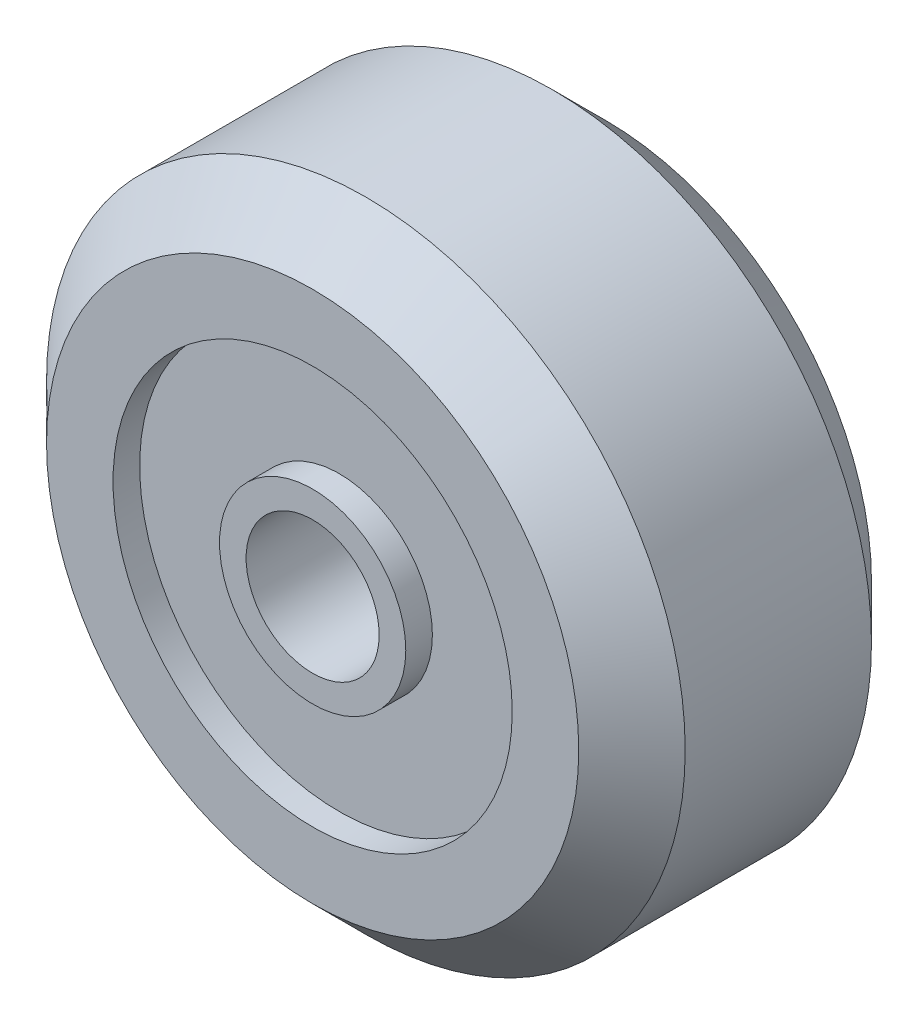
ISO-10303-21;
HEADER;
FILE_DESCRIPTION(('STEP AP214'),'2;1');
FILE_NAME('part.step','',(''),(''),'','','');
FILE_SCHEMA(('AUTOMOTIVE_DESIGN { 1 0 10303 214 1 1 1 1 }'));
ENDSEC;
DATA;
#1=APPLICATION_CONTEXT('core data for automotive mechanical design processes');
#2=APPLICATION_PROTOCOL_DEFINITION('international standard','automotive_design',2000,#1);
#3=PRODUCT_CONTEXT('',#1,'mechanical');
#4=PRODUCT('Part','Part','',(#3));
#5=PRODUCT_RELATED_PRODUCT_CATEGORY('part','',(#4));
#6=PRODUCT_DEFINITION_FORMATION('','',#4);
#7=PRODUCT_DEFINITION_CONTEXT('part definition',#1,'design');
#8=PRODUCT_DEFINITION('design','',#6,#7);
#9=PRODUCT_DEFINITION_SHAPE('','',#8);
#10=(LENGTH_UNIT() NAMED_UNIT(*) SI_UNIT(.MILLI.,.METRE.));
#11=(NAMED_UNIT(*) PLANE_ANGLE_UNIT() SI_UNIT($,.RADIAN.));
#12=(NAMED_UNIT(*) SI_UNIT($,.STERADIAN.) SOLID_ANGLE_UNIT());
#13=UNCERTAINTY_MEASURE_WITH_UNIT(LENGTH_MEASURE(1.E-05),#10,'distance_accuracy_value','');
#14=(GEOMETRIC_REPRESENTATION_CONTEXT(3) GLOBAL_UNCERTAINTY_ASSIGNED_CONTEXT((#13)) GLOBAL_UNIT_ASSIGNED_CONTEXT((#10,
#11,#12)) REPRESENTATION_CONTEXT('',''));
#15=CARTESIAN_POINT('',(0.,0.,0.));
#16=DIRECTION('',(0.,0.,1.));
#17=DIRECTION('',(1.,0.,0.));
#18=AXIS2_PLACEMENT_3D('',#15,#16,#17);
#19=CARTESIAN_POINT('',(0.,0.,0.));
#20=DIRECTION('',(0.,0.,1.));
#21=DIRECTION('',(1.,0.,0.));
#22=AXIS2_PLACEMENT_3D('',#19,#20,#21);
#23=PLANE('',#22);
#24=CARTESIAN_POINT('',(0.,0.,0.));
#25=DIRECTION('',(0.,0.,1.));
#26=DIRECTION('',(1.,0.,0.));
#27=AXIS2_PLACEMENT_3D('',#24,#25,#26);
#28=CIRCLE('',#27,2.5);
#29=CARTESIAN_POINT('',(2.5,0.,0.));
#30=VERTEX_POINT('',#29);
#31=EDGE_CURVE('E60',#30,#30,#28,.T.);
#32=ORIENTED_EDGE('',*,*,#31,.T.);
#33=EDGE_LOOP('',(#32));
#34=FACE_BOUND('',#33,.T.);
#35=CARTESIAN_POINT('',(0.,0.,0.));
#36=DIRECTION('',(0.,0.,-1.));
#37=DIRECTION('',(-1.,0.,0.));
#38=AXIS2_PLACEMENT_3D('',#35,#36,#37);
#39=CIRCLE('',#38,3.5);
#40=CARTESIAN_POINT('',(-3.5,0.,0.));
#41=VERTEX_POINT('',#40);
#42=EDGE_CURVE('E85',#41,#41,#39,.T.);
#43=ORIENTED_EDGE('',*,*,#42,.T.);
#44=EDGE_LOOP('',(#43));
#45=FACE_BOUND('',#44,.T.);
#46=ADVANCED_FACE('F39',(#34,#45),#23,.F.);
#47=CARTESIAN_POINT('',(0.,0.,11.));
#48=DIRECTION('',(0.,0.,1.));
#49=DIRECTION('',(1.,0.,0.));
#50=AXIS2_PLACEMENT_3D('',#47,#48,#49);
#51=PLANE('',#50);
#52=CARTESIAN_POINT('',(0.,0.,11.));
#53=DIRECTION('',(0.,0.,1.));
#54=DIRECTION('',(1.,0.,0.));
#55=AXIS2_PLACEMENT_3D('',#52,#53,#54);
#56=CIRCLE('',#55,2.5);
#57=CARTESIAN_POINT('',(2.5,0.,11.));
#58=VERTEX_POINT('',#57);
#59=EDGE_CURVE('E61',#58,#58,#56,.T.);
#60=ORIENTED_EDGE('',*,*,#59,.F.);
#61=EDGE_LOOP('',(#60));
#62=FACE_BOUND('',#61,.T.);
#63=CARTESIAN_POINT('',(0.,0.,11.));
#64=DIRECTION('',(0.,0.,1.));
#65=DIRECTION('',(1.,0.,0.));
#66=AXIS2_PLACEMENT_3D('',#63,#64,#65);
#67=CIRCLE('',#66,3.5);
#68=CARTESIAN_POINT('',(3.5,0.,11.));
#69=VERTEX_POINT('',#68);
#70=EDGE_CURVE('E73',#69,#69,#67,.T.);
#71=ORIENTED_EDGE('',*,*,#70,.T.);
#72=EDGE_LOOP('',(#71));
#73=FACE_BOUND('',#72,.T.);
#74=ADVANCED_FACE('F120',(#62,#73),#51,.T.);
#75=CARTESIAN_POINT('',(0.,0.,11.));
#76=DIRECTION('',(0.,0.,-1.));
#77=DIRECTION('',(-1.,0.,0.));
#78=AXIS2_PLACEMENT_3D('',#75,#76,#77);
#79=CYLINDRICAL_SURFACE('',#78,12.);
#80=CARTESIAN_POINT('',(0.,0.,2.));
#81=DIRECTION('',(0.,0.,1.));
#82=DIRECTION('',(1.,0.,0.));
#83=AXIS2_PLACEMENT_3D('',#80,#81,#82);
#84=CIRCLE('',#83,12.);
#85=CARTESIAN_POINT('',(12.,0.,2.));
#86=VERTEX_POINT('',#85);
#87=EDGE_CURVE('E51',#86,#86,#84,.T.);
#88=ORIENTED_EDGE('',*,*,#87,.T.);
#89=EDGE_LOOP('',(#88));
#90=FACE_BOUND('',#89,.T.);
#91=CARTESIAN_POINT('',(0.,0.,8.99999999999999));
#92=DIRECTION('',(0.,0.,1.));
#93=DIRECTION('',(1.,0.,0.));
#94=AXIS2_PLACEMENT_3D('',#91,#92,#93);
#95=CIRCLE('',#94,12.);
#96=CARTESIAN_POINT('',(12.,0.,8.99999999999999));
#97=VERTEX_POINT('',#96);
#98=EDGE_CURVE('E55',#97,#97,#95,.F.);
#99=ORIENTED_EDGE('',*,*,#98,.T.);
#100=EDGE_LOOP('',(#99));
#101=FACE_BOUND('',#100,.T.);
#102=ADVANCED_FACE('F117',(#90,#101),#79,.T.);
#103=CARTESIAN_POINT('',(0.,0.,11.));
#104=DIRECTION('',(0.,0.,1.));
#105=DIRECTION('',(1.,0.,0.));
#106=AXIS2_PLACEMENT_3D('',#103,#104,#105);
#107=CIRCLE('',#106,7.5);
#108=CARTESIAN_POINT('',(7.5,0.,11.));
#109=VERTEX_POINT('',#108);
#110=EDGE_CURVE('E67',#109,#109,#107,.T.);
#111=ORIENTED_EDGE('',*,*,#110,.F.);
#112=EDGE_LOOP('',(#111));
#113=FACE_BOUND('',#112,.T.);
#114=CARTESIAN_POINT('',(0.,0.,11.));
#115=DIRECTION('',(0.,0.,1.));
#116=DIRECTION('',(1.,0.,0.));
#117=AXIS2_PLACEMENT_3D('',#114,#115,#116);
#118=CIRCLE('',#117,10.);
#119=CARTESIAN_POINT('',(10.,0.,11.));
#120=VERTEX_POINT('',#119);
#121=EDGE_CURVE('E10',#120,#120,#118,.T.);
#122=ORIENTED_EDGE('',*,*,#121,.T.);
#123=EDGE_LOOP('',(#122));
#124=FACE_BOUND('',#123,.T.);
#125=ADVANCED_FACE('F110',(#113,#124),#51,.T.);
#126=CARTESIAN_POINT('',(0.,0.,0.));
#127=DIRECTION('',(0.,0.,-1.));
#128=DIRECTION('',(-1.,0.,0.));
#129=AXIS2_PLACEMENT_3D('',#126,#127,#128);
#130=CIRCLE('',#129,7.5);
#131=CARTESIAN_POINT('',(-7.5,0.,0.));
#132=VERTEX_POINT('',#131);
#133=EDGE_CURVE('E79',#132,#132,#130,.T.);
#134=ORIENTED_EDGE('',*,*,#133,.F.);
#135=EDGE_LOOP('',(#134));
#136=FACE_BOUND('',#135,.T.);
#137=CARTESIAN_POINT('',(0.,0.,0.));
#138=DIRECTION('',(0.,0.,1.));
#139=DIRECTION('',(1.,0.,0.));
#140=AXIS2_PLACEMENT_3D('',#137,#138,#139);
#141=CIRCLE('',#140,9.99999999999999);
#142=CARTESIAN_POINT('',(9.99999999999999,0.,0.));
#143=VERTEX_POINT('',#142);
#144=EDGE_CURVE('E47',#143,#143,#141,.F.);
#145=ORIENTED_EDGE('',*,*,#144,.T.);
#146=EDGE_LOOP('',(#145));
#147=FACE_BOUND('',#146,.T.);
#148=ADVANCED_FACE('F107',(#136,#147),#23,.F.);
#149=CARTESIAN_POINT('',(0.,0.,2.));
#150=DIRECTION('',(0.,0.,1.));
#151=DIRECTION('',(1.,0.,0.));
#152=AXIS2_PLACEMENT_3D('',#149,#150,#151);
#153=CONICAL_SURFACE('',#152,12.,0.78539816339745);
#154=ORIENTED_EDGE('',*,*,#144,.F.);
#155=EDGE_LOOP('',(#154));
#156=FACE_BOUND('',#155,.T.);
#157=ORIENTED_EDGE('',*,*,#87,.F.);
#158=EDGE_LOOP('',(#157));
#159=FACE_BOUND('',#158,.T.);
#160=ADVANCED_FACE('F109',(#156,#159),#153,.T.);
#161=CARTESIAN_POINT('',(0.,0.,11.));
#162=DIRECTION('',(0.,0.,-1.));
#163=DIRECTION('',(-1.,0.,0.));
#164=AXIS2_PLACEMENT_3D('',#161,#162,#163);
#165=CONICAL_SURFACE('',#164,10.,0.785398163397445);
#166=ORIENTED_EDGE('',*,*,#98,.F.);
#167=EDGE_LOOP('',(#166));
#168=FACE_BOUND('',#167,.T.);
#169=ORIENTED_EDGE('',*,*,#121,.F.);
#170=EDGE_LOOP('',(#169));
#171=FACE_BOUND('',#170,.T.);
#172=ADVANCED_FACE('F42',(#168,#171),#165,.T.);
#173=CARTESIAN_POINT('',(0.,0.,0.));
#174=DIRECTION('',(0.,0.,1.));
#175=DIRECTION('',(1.,0.,0.));
#176=AXIS2_PLACEMENT_3D('',#173,#174,#175);
#177=CYLINDRICAL_SURFACE('',#176,2.5);
#178=ORIENTED_EDGE('',*,*,#31,.F.);
#179=EDGE_LOOP('',(#178));
#180=FACE_BOUND('',#179,.T.);
#181=ORIENTED_EDGE('',*,*,#59,.T.);
#182=EDGE_LOOP('',(#181));
#183=FACE_BOUND('',#182,.T.);
#184=ADVANCED_FACE('F146',(#180,#183),#177,.F.);
#185=CARTESIAN_POINT('',(0.,0.,10.));
#186=DIRECTION('',(0.,0.,1.));
#187=DIRECTION('',(1.,0.,0.));
#188=AXIS2_PLACEMENT_3D('',#185,#186,#187);
#189=CYLINDRICAL_SURFACE('',#188,7.5);
#190=CARTESIAN_POINT('',(0.,0.,10.));
#191=DIRECTION('',(0.,0.,1.));
#192=DIRECTION('',(1.,0.,0.));
#193=AXIS2_PLACEMENT_3D('',#190,#191,#192);
#194=CIRCLE('',#193,7.5);
#195=CARTESIAN_POINT('',(7.5,0.,10.));
#196=VERTEX_POINT('',#195);
#197=EDGE_CURVE('E64',#196,#196,#194,.T.);
#198=ORIENTED_EDGE('',*,*,#197,.F.);
#199=EDGE_LOOP('',(#198));
#200=FACE_BOUND('',#199,.T.);
#201=ORIENTED_EDGE('',*,*,#110,.T.);
#202=EDGE_LOOP('',(#201));
#203=FACE_BOUND('',#202,.T.);
#204=ADVANCED_FACE('F142',(#200,#203),#189,.F.);
#205=CARTESIAN_POINT('',(0.,0.,10.));
#206=DIRECTION('',(0.,0.,1.));
#207=DIRECTION('',(1.,0.,0.));
#208=AXIS2_PLACEMENT_3D('',#205,#206,#207);
#209=PLANE('',#208);
#210=CARTESIAN_POINT('',(0.,0.,10.));
#211=DIRECTION('',(0.,0.,1.));
#212=DIRECTION('',(1.,0.,0.));
#213=AXIS2_PLACEMENT_3D('',#210,#211,#212);
#214=CIRCLE('',#213,3.5);
#215=CARTESIAN_POINT('',(3.5,0.,10.));
#216=VERTEX_POINT('',#215);
#217=EDGE_CURVE('E70',#216,#216,#214,.T.);
#218=ORIENTED_EDGE('',*,*,#217,.F.);
#219=EDGE_LOOP('',(#218));
#220=FACE_BOUND('',#219,.T.);
#221=ORIENTED_EDGE('',*,*,#197,.T.);
#222=EDGE_LOOP('',(#221));
#223=FACE_BOUND('',#222,.T.);
#224=ADVANCED_FACE('F138',(#220,#223),#209,.T.);
#225=CARTESIAN_POINT('',(0.,0.,10.));
#226=DIRECTION('',(0.,0.,1.));
#227=DIRECTION('',(1.,0.,0.));
#228=AXIS2_PLACEMENT_3D('',#225,#226,#227);
#229=CYLINDRICAL_SURFACE('',#228,3.5);
#230=ORIENTED_EDGE('',*,*,#217,.T.);
#231=EDGE_LOOP('',(#230));
#232=FACE_BOUND('',#231,.T.);
#233=ORIENTED_EDGE('',*,*,#70,.F.);
#234=EDGE_LOOP('',(#233));
#235=FACE_BOUND('',#234,.T.);
#236=ADVANCED_FACE('F103',(#232,#235),#229,.T.);
#237=CARTESIAN_POINT('',(0.,0.,1.));
#238=DIRECTION('',(0.,0.,-1.));
#239=DIRECTION('',(-1.,0.,0.));
#240=AXIS2_PLACEMENT_3D('',#237,#238,#239);
#241=CYLINDRICAL_SURFACE('',#240,7.5);
#242=CARTESIAN_POINT('',(0.,0.,1.));
#243=DIRECTION('',(0.,0.,-1.));
#244=DIRECTION('',(-1.,0.,0.));
#245=AXIS2_PLACEMENT_3D('',#242,#243,#244);
#246=CIRCLE('',#245,7.5);
#247=CARTESIAN_POINT('',(-7.5,0.,1.));
#248=VERTEX_POINT('',#247);
#249=EDGE_CURVE('E76',#248,#248,#246,.T.);
#250=ORIENTED_EDGE('',*,*,#249,.F.);
#251=EDGE_LOOP('',(#250));
#252=FACE_BOUND('',#251,.T.);
#253=ORIENTED_EDGE('',*,*,#133,.T.);
#254=EDGE_LOOP('',(#253));
#255=FACE_BOUND('',#254,.T.);
#256=ADVANCED_FACE('F97',(#252,#255),#241,.F.);
#257=CARTESIAN_POINT('',(0.,0.,1.));
#258=DIRECTION('',(0.,0.,-1.));
#259=DIRECTION('',(-1.,0.,0.));
#260=AXIS2_PLACEMENT_3D('',#257,#258,#259);
#261=PLANE('',#260);
#262=CARTESIAN_POINT('',(0.,0.,1.));
#263=DIRECTION('',(0.,0.,-1.));
#264=DIRECTION('',(-1.,0.,0.));
#265=AXIS2_PLACEMENT_3D('',#262,#263,#264);
#266=CIRCLE('',#265,3.5);
#267=CARTESIAN_POINT('',(-3.5,0.,1.));
#268=VERTEX_POINT('',#267);
#269=EDGE_CURVE('E82',#268,#268,#266,.T.);
#270=ORIENTED_EDGE('',*,*,#269,.F.);
#271=EDGE_LOOP('',(#270));
#272=FACE_BOUND('',#271,.T.);
#273=ORIENTED_EDGE('',*,*,#249,.T.);
#274=EDGE_LOOP('',(#273));
#275=FACE_BOUND('',#274,.T.);
#276=ADVANCED_FACE('F94',(#272,#275),#261,.T.);
#277=CARTESIAN_POINT('',(0.,0.,1.));
#278=DIRECTION('',(0.,0.,-1.));
#279=DIRECTION('',(-1.,0.,0.));
#280=AXIS2_PLACEMENT_3D('',#277,#278,#279);
#281=CYLINDRICAL_SURFACE('',#280,3.5);
#282=ORIENTED_EDGE('',*,*,#269,.T.);
#283=EDGE_LOOP('',(#282));
#284=FACE_BOUND('',#283,.T.);
#285=ORIENTED_EDGE('',*,*,#42,.F.);
#286=EDGE_LOOP('',(#285));
#287=FACE_BOUND('',#286,.T.);
#288=ADVANCED_FACE('F91',(#284,#287),#281,.T.);
#289=CLOSED_SHELL('',(#46,#74,#102,#125,#148,#160,#172,#184,#204,#224,#236,#256,#276,#288));
#290=MANIFOLD_SOLID_BREP('B2',#289);
#291=ADVANCED_BREP_SHAPE_REPRESENTATION('',(#18,#290),#14);
#292=SHAPE_DEFINITION_REPRESENTATION(#9,#291);
ENDSEC;
END-ISO-10303-21;
